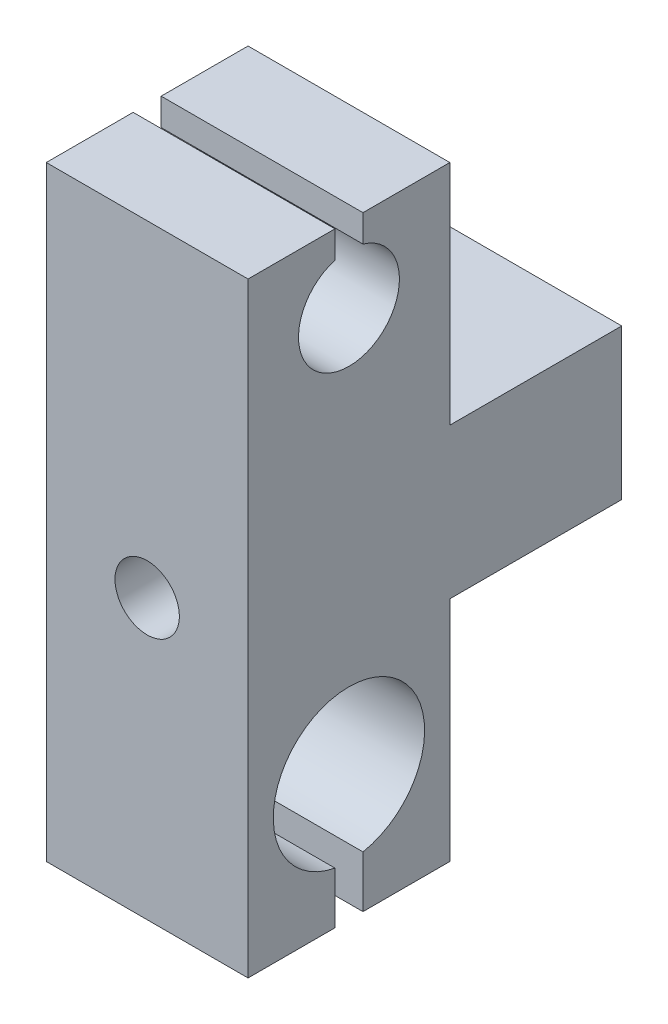
ISO-10303-21;
HEADER;
FILE_DESCRIPTION(('STEP AP214'),'2;1');
FILE_NAME('part.step','',(''),(''),'','','');
FILE_SCHEMA(('AUTOMOTIVE_DESIGN { 1 0 10303 214 1 1 1 1 }'));
ENDSEC;
DATA;
#1=APPLICATION_CONTEXT('core data for automotive mechanical design processes');
#2=APPLICATION_PROTOCOL_DEFINITION('international standard','automotive_design',2000,#1);
#3=PRODUCT_CONTEXT('',#1,'mechanical');
#4=PRODUCT('Part','Part','',(#3));
#5=PRODUCT_RELATED_PRODUCT_CATEGORY('part','',(#4));
#6=PRODUCT_DEFINITION_FORMATION('','',#4);
#7=PRODUCT_DEFINITION_CONTEXT('part definition',#1,'design');
#8=PRODUCT_DEFINITION('design','',#6,#7);
#9=PRODUCT_DEFINITION_SHAPE('','',#8);
#10=(LENGTH_UNIT() NAMED_UNIT(*) SI_UNIT(.MILLI.,.METRE.));
#11=(NAMED_UNIT(*) PLANE_ANGLE_UNIT() SI_UNIT($,.RADIAN.));
#12=(NAMED_UNIT(*) SI_UNIT($,.STERADIAN.) SOLID_ANGLE_UNIT());
#13=UNCERTAINTY_MEASURE_WITH_UNIT(LENGTH_MEASURE(1.E-05),#10,'distance_accuracy_value','');
#14=(GEOMETRIC_REPRESENTATION_CONTEXT(3) GLOBAL_UNCERTAINTY_ASSIGNED_CONTEXT((#13)) GLOBAL_UNIT_ASSIGNED_CONTEXT((#10,
#11,#12)) REPRESENTATION_CONTEXT('',''));
#15=CARTESIAN_POINT('',(0.,0.,0.));
#16=DIRECTION('',(0.,0.,1.));
#17=DIRECTION('',(1.,0.,0.));
#18=AXIS2_PLACEMENT_3D('',#15,#16,#17);
#19=CARTESIAN_POINT('',(25.4,38.1,1.76481784286325));
#20=DIRECTION('',(0.,-1.,0.));
#21=DIRECTION('',(0.,0.,-1.));
#22=AXIS2_PLACEMENT_3D('',#19,#20,#21);
#23=PLANE('',#22);
#24=DIRECTION('',(0.,0.,1.));
#25=VECTOR('',#24,1.);
#26=CARTESIAN_POINT('',(0.,38.1,1.76481784286325));
#27=LINE('',#26,#25);
#28=CARTESIAN_POINT('',(0.,38.1,1.76481784286325));
#29=VERTEX_POINT('',#28);
#30=CARTESIAN_POINT('',(0.,38.1,12.7));
#31=VERTEX_POINT('',#30);
#32=EDGE_CURVE('E180',#29,#31,#27,.T.);
#33=ORIENTED_EDGE('',*,*,#32,.T.);
#34=DIRECTION('',(-1.,0.,0.));
#35=VECTOR('',#34,1.);
#36=CARTESIAN_POINT('',(25.4,38.1,12.7));
#37=LINE('',#36,#35);
#38=CARTESIAN_POINT('',(25.4,38.1,12.7));
#39=VERTEX_POINT('',#38);
#40=EDGE_CURVE('E11',#39,#31,#37,.T.);
#41=ORIENTED_EDGE('',*,*,#40,.F.);
#42=DIRECTION('',(0.,0.,1.));
#43=VECTOR('',#42,1.);
#44=CARTESIAN_POINT('',(25.4,38.1,1.76481784286325));
#45=LINE('',#44,#43);
#46=CARTESIAN_POINT('',(25.4,38.1,1.76481784286325));
#47=VERTEX_POINT('',#46);
#48=EDGE_CURVE('E211',#47,#39,#45,.T.);
#49=ORIENTED_EDGE('',*,*,#48,.F.);
#50=DIRECTION('',(-1.,0.,0.));
#51=VECTOR('',#50,1.);
#52=CARTESIAN_POINT('',(25.4,38.1,1.76481784286325));
#53=LINE('',#52,#51);
#54=EDGE_CURVE('E176',#47,#29,#53,.T.);
#55=ORIENTED_EDGE('',*,*,#54,.T.);
#56=EDGE_LOOP('',(#33,#41,#49,#55));
#57=FACE_BOUND('',#56,.T.);
#58=ADVANCED_FACE('F36',(#57),#23,.F.);
#59=CARTESIAN_POINT('',(25.4,-38.1,12.7));
#60=DIRECTION('',(0.,0.,-1.));
#61=DIRECTION('',(-1.,0.,0.));
#62=AXIS2_PLACEMENT_3D('',#59,#60,#61);
#63=PLANE('',#62);
#64=CARTESIAN_POINT('',(12.7,-3.0027725286965,12.7));
#65=DIRECTION('',(0.,0.,-1.));
#66=DIRECTION('',(-1.,0.,0.));
#67=AXIS2_PLACEMENT_3D('',#64,#65,#66);
#68=CIRCLE('',#67,4.04999999968396);
#69=CARTESIAN_POINT('',(8.65000000031604,-3.0027725286965,12.7));
#70=VERTEX_POINT('',#69);
#71=EDGE_CURVE('E184',#70,#70,#68,.T.);
#72=ORIENTED_EDGE('',*,*,#71,.T.);
#73=EDGE_LOOP('',(#72));
#74=FACE_BOUND('',#73,.T.);
#75=DIRECTION('',(0.,-1.,0.));
#76=VECTOR('',#75,1.);
#77=CARTESIAN_POINT('',(0.,-38.1,12.7));
#78=LINE('',#77,#76);
#79=CARTESIAN_POINT('',(0.,-38.1,12.7));
#80=VERTEX_POINT('',#79);
#81=EDGE_CURVE('E183',#31,#80,#78,.T.);
#82=ORIENTED_EDGE('',*,*,#81,.T.);
#83=DIRECTION('',(-1.,0.,0.));
#84=VECTOR('',#83,1.);
#85=CARTESIAN_POINT('',(25.4,-38.1,12.7));
#86=LINE('',#85,#84);
#87=CARTESIAN_POINT('',(25.4,-38.1,12.7));
#88=VERTEX_POINT('',#87);
#89=EDGE_CURVE('E44',#88,#80,#86,.T.);
#90=ORIENTED_EDGE('',*,*,#89,.F.);
#91=DIRECTION('',(0.,-1.,0.));
#92=VECTOR('',#91,1.);
#93=CARTESIAN_POINT('',(25.4,-38.1,12.7));
#94=LINE('',#93,#92);
#95=EDGE_CURVE('E119',#39,#88,#94,.T.);
#96=ORIENTED_EDGE('',*,*,#95,.F.);
#97=ORIENTED_EDGE('',*,*,#40,.T.);
#98=EDGE_LOOP('',(#82,#90,#96,#97));
#99=FACE_BOUND('',#98,.T.);
#100=ADVANCED_FACE('F309',(#74,#99),#63,.F.);
#101=CARTESIAN_POINT('',(25.4,-38.1,1.76481784286325));
#102=DIRECTION('',(0.,1.,0.));
#103=DIRECTION('',(0.,0.,1.));
#104=AXIS2_PLACEMENT_3D('',#101,#102,#103);
#105=PLANE('',#104);
#106=DIRECTION('',(0.,0.,-1.));
#107=VECTOR('',#106,1.);
#108=CARTESIAN_POINT('',(0.,-38.1,1.76481784286325));
#109=LINE('',#108,#107);
#110=CARTESIAN_POINT('',(0.,-38.1,1.76481784286325));
#111=VERTEX_POINT('',#110);
#112=EDGE_CURVE('E186',#80,#111,#109,.T.);
#113=ORIENTED_EDGE('',*,*,#112,.T.);
#114=DIRECTION('',(-1.,0.,0.));
#115=VECTOR('',#114,1.);
#116=CARTESIAN_POINT('',(25.4,-38.1,1.76481784286325));
#117=LINE('',#116,#115);
#118=CARTESIAN_POINT('',(25.4,-38.1,1.76481784286325));
#119=VERTEX_POINT('',#118);
#120=EDGE_CURVE('E242',#119,#111,#117,.T.);
#121=ORIENTED_EDGE('',*,*,#120,.F.);
#122=DIRECTION('',(0.,0.,-1.));
#123=VECTOR('',#122,1.);
#124=CARTESIAN_POINT('',(25.4,-38.1,1.76481784286325));
#125=LINE('',#124,#123);
#126=EDGE_CURVE('E250',#88,#119,#125,.T.);
#127=ORIENTED_EDGE('',*,*,#126,.F.);
#128=ORIENTED_EDGE('',*,*,#89,.T.);
#129=EDGE_LOOP('',(#113,#121,#127,#128));
#130=FACE_BOUND('',#129,.T.);
#131=ADVANCED_FACE('F248',(#130),#105,.F.);
#132=CARTESIAN_POINT('',(25.4,-31.5850770820283,1.76481784286325));
#133=DIRECTION('',(0.,0.,1.));
#134=DIRECTION('',(1.,0.,0.));
#135=AXIS2_PLACEMENT_3D('',#132,#133,#134);
#136=PLANE('',#135);
#137=DIRECTION('',(0.,1.,0.));
#138=VECTOR('',#137,1.);
#139=CARTESIAN_POINT('',(0.,-31.5850770820283,1.76481784286325));
#140=LINE('',#139,#138);
#141=CARTESIAN_POINT('',(0.,-31.5850770820283,1.76481784286325));
#142=VERTEX_POINT('',#141);
#143=EDGE_CURVE('E188',#111,#142,#140,.T.);
#144=ORIENTED_EDGE('',*,*,#143,.T.);
#145=DIRECTION('',(-1.,0.,0.));
#146=VECTOR('',#145,1.);
#147=CARTESIAN_POINT('',(25.4,-31.5850770820283,1.76481784286325));
#148=LINE('',#147,#146);
#149=CARTESIAN_POINT('',(25.4,-31.5850770820283,1.76481784286325));
#150=VERTEX_POINT('',#149);
#151=EDGE_CURVE('E239',#150,#142,#148,.T.);
#152=ORIENTED_EDGE('',*,*,#151,.F.);
#153=DIRECTION('',(0.,1.,0.));
#154=VECTOR('',#153,1.);
#155=CARTESIAN_POINT('',(25.4,-31.5850770820283,1.76481784286325));
#156=LINE('',#155,#154);
#157=EDGE_CURVE('E268',#119,#150,#156,.T.);
#158=ORIENTED_EDGE('',*,*,#157,.F.);
#159=ORIENTED_EDGE('',*,*,#120,.T.);
#160=EDGE_LOOP('',(#144,#152,#158,#159));
#161=FACE_BOUND('',#160,.T.);
#162=ADVANCED_FACE('F259',(#161),#136,.F.);
#163=CARTESIAN_POINT('',(25.4,-22.225,0.));
#164=DIRECTION('',(-1.,0.,0.));
#165=DIRECTION('',(0.,0.,1.));
#166=AXIS2_PLACEMENT_3D('',#163,#164,#165);
#167=CYLINDRICAL_SURFACE('',#166,9.525);
#168=CARTESIAN_POINT('',(0.,-22.225,0.));
#169=DIRECTION('',(-1.,0.,0.));
#170=DIRECTION('',(0.,0.,-1.));
#171=AXIS2_PLACEMENT_3D('',#168,#169,#170);
#172=CIRCLE('',#171,9.525);
#173=CARTESIAN_POINT('',(0.,-31.5850770820283,-1.76481784286326));
#174=VERTEX_POINT('',#173);
#175=EDGE_CURVE('E190',#142,#174,#172,.T.);
#176=ORIENTED_EDGE('',*,*,#175,.T.);
#177=DIRECTION('',(-1.,0.,0.));
#178=VECTOR('',#177,1.);
#179=CARTESIAN_POINT('',(25.4,-31.5850770820283,-1.76481784286326));
#180=LINE('',#179,#178);
#181=CARTESIAN_POINT('',(25.4,-31.5850770820283,-1.76481784286326));
#182=VERTEX_POINT('',#181);
#183=EDGE_CURVE('E236',#182,#174,#180,.T.);
#184=ORIENTED_EDGE('',*,*,#183,.F.);
#185=CARTESIAN_POINT('',(25.4,-22.225,0.));
#186=DIRECTION('',(-1.,0.,0.));
#187=DIRECTION('',(0.,0.,-1.));
#188=AXIS2_PLACEMENT_3D('',#185,#186,#187);
#189=CIRCLE('',#188,9.525);
#190=EDGE_CURVE('E265',#150,#182,#189,.T.);
#191=ORIENTED_EDGE('',*,*,#190,.F.);
#192=ORIENTED_EDGE('',*,*,#151,.T.);
#193=EDGE_LOOP('',(#176,#184,#191,#192));
#194=FACE_BOUND('',#193,.T.);
#195=ADVANCED_FACE('F263',(#194),#167,.F.);
#196=CARTESIAN_POINT('',(25.4,-31.5850770820283,-1.76481784286326));
#197=DIRECTION('',(0.,0.,-1.));
#198=DIRECTION('',(0.,1.,0.));
#199=AXIS2_PLACEMENT_3D('',#196,#197,#198);
#200=PLANE('',#199);
#201=DIRECTION('',(0.,-1.,0.));
#202=VECTOR('',#201,1.);
#203=CARTESIAN_POINT('',(0.,-31.5850770820283,-1.76481784286326));
#204=LINE('',#203,#202);
#205=CARTESIAN_POINT('',(0.,-38.1,-1.76481784286326));
#206=VERTEX_POINT('',#205);
#207=EDGE_CURVE('E192',#174,#206,#204,.T.);
#208=ORIENTED_EDGE('',*,*,#207,.T.);
#209=DIRECTION('',(-1.,0.,0.));
#210=VECTOR('',#209,1.);
#211=CARTESIAN_POINT('',(25.4,-38.1,-1.76481784286326));
#212=LINE('',#211,#210);
#213=CARTESIAN_POINT('',(25.4,-38.1,-1.76481784286326));
#214=VERTEX_POINT('',#213);
#215=EDGE_CURVE('E233',#214,#206,#212,.T.);
#216=ORIENTED_EDGE('',*,*,#215,.F.);
#217=DIRECTION('',(0.,-1.,0.));
#218=VECTOR('',#217,1.);
#219=CARTESIAN_POINT('',(25.4,-31.5850770820283,-1.76481784286326));
#220=LINE('',#219,#218);
#221=EDGE_CURVE('E267',#182,#214,#220,.T.);
#222=ORIENTED_EDGE('',*,*,#221,.F.);
#223=ORIENTED_EDGE('',*,*,#183,.T.);
#224=EDGE_LOOP('',(#208,#216,#222,#223));
#225=FACE_BOUND('',#224,.T.);
#226=ADVANCED_FACE('F324',(#225),#200,.F.);
#227=CARTESIAN_POINT('',(25.4,-38.1,-12.7));
#228=DIRECTION('',(0.,1.,0.));
#229=DIRECTION('',(0.,0.,1.));
#230=AXIS2_PLACEMENT_3D('',#227,#228,#229);
#231=PLANE('',#230);
#232=DIRECTION('',(0.,0.,-1.));
#233=VECTOR('',#232,1.);
#234=CARTESIAN_POINT('',(0.,-38.1,-12.7));
#235=LINE('',#234,#233);
#236=CARTESIAN_POINT('',(0.,-38.1,-12.7));
#237=VERTEX_POINT('',#236);
#238=EDGE_CURVE('E194',#206,#237,#235,.T.);
#239=ORIENTED_EDGE('',*,*,#238,.T.);
#240=DIRECTION('',(-1.,0.,0.));
#241=VECTOR('',#240,1.);
#242=CARTESIAN_POINT('',(25.4,-38.1,-12.7));
#243=LINE('',#242,#241);
#244=CARTESIAN_POINT('',(25.4,-38.1,-12.7));
#245=VERTEX_POINT('',#244);
#246=EDGE_CURVE('E230',#245,#237,#243,.T.);
#247=ORIENTED_EDGE('',*,*,#246,.F.);
#248=DIRECTION('',(0.,0.,-1.));
#249=VECTOR('',#248,1.);
#250=CARTESIAN_POINT('',(25.4,-38.1,-12.7));
#251=LINE('',#250,#249);
#252=EDGE_CURVE('E270',#214,#245,#251,.T.);
#253=ORIENTED_EDGE('',*,*,#252,.F.);
#254=ORIENTED_EDGE('',*,*,#215,.T.);
#255=EDGE_LOOP('',(#239,#247,#253,#254));
#256=FACE_BOUND('',#255,.T.);
#257=ADVANCED_FACE('F327',(#256),#231,.F.);
#258=CARTESIAN_POINT('',(25.4,-38.1,-12.7));
#259=DIRECTION('',(0.,0.,1.));
#260=DIRECTION('',(1.,0.,0.));
#261=AXIS2_PLACEMENT_3D('',#258,#259,#260);
#262=PLANE('',#261);
#263=DIRECTION('',(0.,1.,0.));
#264=VECTOR('',#263,1.);
#265=CARTESIAN_POINT('',(0.,-38.1,-12.7));
#266=LINE('',#265,#264);
#267=CARTESIAN_POINT('',(0.,-9.46650416011348,-12.7));
#268=VERTEX_POINT('',#267);
#269=EDGE_CURVE('E196',#237,#268,#266,.T.);
#270=ORIENTED_EDGE('',*,*,#269,.T.);
#271=DIRECTION('',(-1.,0.,0.));
#272=VECTOR('',#271,1.);
#273=CARTESIAN_POINT('',(25.4,-9.46650416011348,-12.7));
#274=LINE('',#273,#272);
#275=CARTESIAN_POINT('',(25.4,-9.46650416011348,-12.7));
#276=VERTEX_POINT('',#275);
#277=EDGE_CURVE('E227',#276,#268,#274,.T.);
#278=ORIENTED_EDGE('',*,*,#277,.F.);
#279=DIRECTION('',(0.,1.,0.));
#280=VECTOR('',#279,1.);
#281=CARTESIAN_POINT('',(25.4,-38.1,-12.7));
#282=LINE('',#281,#280);
#283=EDGE_CURVE('E276',#245,#276,#282,.T.);
#284=ORIENTED_EDGE('',*,*,#283,.F.);
#285=ORIENTED_EDGE('',*,*,#246,.T.);
#286=EDGE_LOOP('',(#270,#278,#284,#285));
#287=FACE_BOUND('',#286,.T.);
#288=ADVANCED_FACE('F331',(#287),#262,.F.);
#289=CARTESIAN_POINT('',(25.4,-9.46650416011348,-34.3377));
#290=DIRECTION('',(0.,1.,0.));
#291=DIRECTION('',(0.,0.,1.));
#292=AXIS2_PLACEMENT_3D('',#289,#290,#291);
#293=PLANE('',#292);
#294=DIRECTION('',(0.,0.,-1.));
#295=VECTOR('',#294,1.);
#296=CARTESIAN_POINT('',(0.,-9.46650416011348,-34.3377));
#297=LINE('',#296,#295);
#298=CARTESIAN_POINT('',(0.,-9.46650416011348,-34.3377));
#299=VERTEX_POINT('',#298);
#300=EDGE_CURVE('E198',#268,#299,#297,.T.);
#301=ORIENTED_EDGE('',*,*,#300,.T.);
#302=DIRECTION('',(-1.,0.,0.));
#303=VECTOR('',#302,1.);
#304=CARTESIAN_POINT('',(25.4,-9.46650416011348,-34.3377));
#305=LINE('',#304,#303);
#306=CARTESIAN_POINT('',(25.4,-9.46650416011348,-34.3377));
#307=VERTEX_POINT('',#306);
#308=EDGE_CURVE('E224',#307,#299,#305,.T.);
#309=ORIENTED_EDGE('',*,*,#308,.F.);
#310=DIRECTION('',(0.,0.,-1.));
#311=VECTOR('',#310,1.);
#312=CARTESIAN_POINT('',(25.4,-9.46650416011348,-34.3377));
#313=LINE('',#312,#311);
#314=EDGE_CURVE('E278',#276,#307,#313,.T.);
#315=ORIENTED_EDGE('',*,*,#314,.F.);
#316=ORIENTED_EDGE('',*,*,#277,.T.);
#317=EDGE_LOOP('',(#301,#309,#315,#316));
#318=FACE_BOUND('',#317,.T.);
#319=ADVANCED_FACE('F335',(#318),#293,.F.);
#320=CARTESIAN_POINT('',(25.4,-9.46650416011348,-34.3377));
#321=DIRECTION('',(0.,0.,1.));
#322=DIRECTION('',(1.,0.,0.));
#323=AXIS2_PLACEMENT_3D('',#320,#321,#322);
#324=PLANE('',#323);
#325=CARTESIAN_POINT('',(12.7,-3.0027725286965,-34.3377));
#326=DIRECTION('',(0.,0.,-1.));
#327=DIRECTION('',(-1.,0.,0.));
#328=AXIS2_PLACEMENT_3D('',#325,#326,#327);
#329=CIRCLE('',#328,4.04999999968396);
#330=CARTESIAN_POINT('',(8.65000000031604,-3.0027725286965,-34.3377));
#331=VERTEX_POINT('',#330);
#332=EDGE_CURVE('E410',#331,#331,#329,.T.);
#333=ORIENTED_EDGE('',*,*,#332,.F.);
#334=EDGE_LOOP('',(#333));
#335=FACE_BOUND('',#334,.T.);
#336=DIRECTION('',(0.,1.,0.));
#337=VECTOR('',#336,1.);
#338=CARTESIAN_POINT('',(0.,-9.46650416011348,-34.3377));
#339=LINE('',#338,#337);
#340=CARTESIAN_POINT('',(0.,9.46650416011348,-34.3377));
#341=VERTEX_POINT('',#340);
#342=EDGE_CURVE('E200',#299,#341,#339,.T.);
#343=ORIENTED_EDGE('',*,*,#342,.T.);
#344=DIRECTION('',(-1.,0.,0.));
#345=VECTOR('',#344,1.);
#346=CARTESIAN_POINT('',(25.4,9.46650416011348,-34.3377));
#347=LINE('',#346,#345);
#348=CARTESIAN_POINT('',(25.4,9.46650416011348,-34.3377));
#349=VERTEX_POINT('',#348);
#350=EDGE_CURVE('E221',#349,#341,#347,.T.);
#351=ORIENTED_EDGE('',*,*,#350,.F.);
#352=DIRECTION('',(0.,1.,0.));
#353=VECTOR('',#352,1.);
#354=CARTESIAN_POINT('',(25.4,-9.46650416011348,-34.3377));
#355=LINE('',#354,#353);
#356=EDGE_CURVE('E280',#307,#349,#355,.T.);
#357=ORIENTED_EDGE('',*,*,#356,.F.);
#358=ORIENTED_EDGE('',*,*,#308,.T.);
#359=EDGE_LOOP('',(#343,#351,#357,#358));
#360=FACE_BOUND('',#359,.T.);
#361=ADVANCED_FACE('F339',(#335,#360),#324,.F.);
#362=CARTESIAN_POINT('',(25.4,9.46650416011348,-34.3377));
#363=DIRECTION('',(0.,-1.,0.));
#364=DIRECTION('',(0.,0.,-1.));
#365=AXIS2_PLACEMENT_3D('',#362,#363,#364);
#366=PLANE('',#365);
#367=DIRECTION('',(0.,0.,1.));
#368=VECTOR('',#367,1.);
#369=CARTESIAN_POINT('',(0.,9.46650416011348,-34.3377));
#370=LINE('',#369,#368);
#371=CARTESIAN_POINT('',(0.,9.46650416011348,-12.7));
#372=VERTEX_POINT('',#371);
#373=EDGE_CURVE('E202',#341,#372,#370,.T.);
#374=ORIENTED_EDGE('',*,*,#373,.T.);
#375=DIRECTION('',(-1.,0.,0.));
#376=VECTOR('',#375,1.);
#377=CARTESIAN_POINT('',(25.4,9.46650416011348,-12.7));
#378=LINE('',#377,#376);
#379=CARTESIAN_POINT('',(25.4,9.46650416011348,-12.7));
#380=VERTEX_POINT('',#379);
#381=EDGE_CURVE('E218',#380,#372,#378,.T.);
#382=ORIENTED_EDGE('',*,*,#381,.F.);
#383=DIRECTION('',(0.,0.,1.));
#384=VECTOR('',#383,1.);
#385=CARTESIAN_POINT('',(25.4,9.46650416011348,-34.3377));
#386=LINE('',#385,#384);
#387=EDGE_CURVE('E282',#349,#380,#386,.T.);
#388=ORIENTED_EDGE('',*,*,#387,.F.);
#389=ORIENTED_EDGE('',*,*,#350,.T.);
#390=EDGE_LOOP('',(#374,#382,#388,#389));
#391=FACE_BOUND('',#390,.T.);
#392=ADVANCED_FACE('F343',(#391),#366,.F.);
#393=CARTESIAN_POINT('',(25.4,9.46650416011348,-12.7));
#394=DIRECTION('',(0.,0.,1.));
#395=DIRECTION('',(1.,0.,0.));
#396=AXIS2_PLACEMENT_3D('',#393,#394,#395);
#397=PLANE('',#396);
#398=DIRECTION('',(0.,1.,0.));
#399=VECTOR('',#398,1.);
#400=CARTESIAN_POINT('',(0.,9.46650416011348,-12.7));
#401=LINE('',#400,#399);
#402=CARTESIAN_POINT('',(0.,38.1,-12.7));
#403=VERTEX_POINT('',#402);
#404=EDGE_CURVE('E204',#372,#403,#401,.T.);
#405=ORIENTED_EDGE('',*,*,#404,.T.);
#406=DIRECTION('',(-1.,0.,0.));
#407=VECTOR('',#406,1.);
#408=CARTESIAN_POINT('',(25.4,38.1,-12.7));
#409=LINE('',#408,#407);
#410=CARTESIAN_POINT('',(25.4,38.1,-12.7));
#411=VERTEX_POINT('',#410);
#412=EDGE_CURVE('E215',#411,#403,#409,.T.);
#413=ORIENTED_EDGE('',*,*,#412,.F.);
#414=DIRECTION('',(0.,1.,0.));
#415=VECTOR('',#414,1.);
#416=CARTESIAN_POINT('',(25.4,9.46650416011348,-12.7));
#417=LINE('',#416,#415);
#418=EDGE_CURVE('E284',#380,#411,#417,.T.);
#419=ORIENTED_EDGE('',*,*,#418,.F.);
#420=ORIENTED_EDGE('',*,*,#381,.T.);
#421=EDGE_LOOP('',(#405,#413,#419,#420));
#422=FACE_BOUND('',#421,.T.);
#423=ADVANCED_FACE('F290',(#422),#397,.F.);
#424=CARTESIAN_POINT('',(25.4,38.1,-12.7));
#425=DIRECTION('',(0.,-1.,0.));
#426=DIRECTION('',(0.,0.,-1.));
#427=AXIS2_PLACEMENT_3D('',#424,#425,#426);
#428=PLANE('',#427);
#429=DIRECTION('',(0.,0.,1.));
#430=VECTOR('',#429,1.);
#431=CARTESIAN_POINT('',(0.,38.1,-12.7));
#432=LINE('',#431,#430);
#433=CARTESIAN_POINT('',(0.,38.1,-1.76481784286325));
#434=VERTEX_POINT('',#433);
#435=EDGE_CURVE('E206',#403,#434,#432,.T.);
#436=ORIENTED_EDGE('',*,*,#435,.T.);
#437=DIRECTION('',(-1.,0.,0.));
#438=VECTOR('',#437,1.);
#439=CARTESIAN_POINT('',(25.4,38.1,-1.76481784286325));
#440=LINE('',#439,#438);
#441=CARTESIAN_POINT('',(25.4,38.1,-1.76481784286325));
#442=VERTEX_POINT('',#441);
#443=EDGE_CURVE('E171',#442,#434,#440,.T.);
#444=ORIENTED_EDGE('',*,*,#443,.F.);
#445=DIRECTION('',(0.,0.,1.));
#446=VECTOR('',#445,1.);
#447=CARTESIAN_POINT('',(25.4,38.1,-12.7));
#448=LINE('',#447,#446);
#449=EDGE_CURVE('E162',#411,#442,#448,.T.);
#450=ORIENTED_EDGE('',*,*,#449,.F.);
#451=ORIENTED_EDGE('',*,*,#412,.T.);
#452=EDGE_LOOP('',(#436,#444,#450,#451));
#453=FACE_BOUND('',#452,.T.);
#454=ADVANCED_FACE('F294',(#453),#428,.F.);
#455=CARTESIAN_POINT('',(25.4,38.1,-1.76481784286325));
#456=DIRECTION('',(0.,0.,-1.));
#457=DIRECTION('',(-1.,0.,0.));
#458=AXIS2_PLACEMENT_3D('',#455,#456,#457);
#459=PLANE('',#458);
#460=DIRECTION('',(0.,-1.,0.));
#461=VECTOR('',#460,1.);
#462=CARTESIAN_POINT('',(0.,38.1,-1.76481784286325));
#463=LINE('',#462,#461);
#464=CARTESIAN_POINT('',(0.,34.6748293403596,-1.76481784286325));
#465=VERTEX_POINT('',#464);
#466=EDGE_CURVE('E170',#434,#465,#463,.T.);
#467=ORIENTED_EDGE('',*,*,#466,.T.);
#468=DIRECTION('',(-1.,0.,0.));
#469=VECTOR('',#468,1.);
#470=CARTESIAN_POINT('',(25.4,34.6748293403596,-1.76481784286325));
#471=LINE('',#470,#469);
#472=CARTESIAN_POINT('',(25.4,34.6748293403596,-1.76481784286325));
#473=VERTEX_POINT('',#472);
#474=EDGE_CURVE('E167',#473,#465,#471,.T.);
#475=ORIENTED_EDGE('',*,*,#474,.F.);
#476=DIRECTION('',(0.,-1.,0.));
#477=VECTOR('',#476,1.);
#478=CARTESIAN_POINT('',(25.4,38.1,-1.76481784286325));
#479=LINE('',#478,#477);
#480=EDGE_CURVE('E156',#442,#473,#479,.T.);
#481=ORIENTED_EDGE('',*,*,#480,.F.);
#482=ORIENTED_EDGE('',*,*,#443,.T.);
#483=EDGE_LOOP('',(#467,#475,#481,#482));
#484=FACE_BOUND('',#483,.T.);
#485=ADVANCED_FACE('F168',(#484),#459,.F.);
#486=CARTESIAN_POINT('',(25.4,28.575,0.));
#487=DIRECTION('',(-1.,0.,0.));
#488=DIRECTION('',(0.,0.,1.));
#489=AXIS2_PLACEMENT_3D('',#486,#487,#488);
#490=CYLINDRICAL_SURFACE('',#489,6.35);
#491=CARTESIAN_POINT('',(0.,28.575,0.));
#492=DIRECTION('',(-1.,0.,0.));
#493=DIRECTION('',(0.,0.,-1.));
#494=AXIS2_PLACEMENT_3D('',#491,#492,#493);
#495=CIRCLE('',#494,6.35);
#496=CARTESIAN_POINT('',(0.,34.6748293403596,1.76481784286325));
#497=VERTEX_POINT('',#496);
#498=EDGE_CURVE('E105',#465,#497,#495,.T.);
#499=ORIENTED_EDGE('',*,*,#498,.T.);
#500=DIRECTION('',(-1.,0.,0.));
#501=VECTOR('',#500,1.);
#502=CARTESIAN_POINT('',(25.4,34.6748293403596,1.76481784286325));
#503=LINE('',#502,#501);
#504=CARTESIAN_POINT('',(25.4,34.6748293403596,1.76481784286325));
#505=VERTEX_POINT('',#504);
#506=EDGE_CURVE('E172',#505,#497,#503,.T.);
#507=ORIENTED_EDGE('',*,*,#506,.F.);
#508=CARTESIAN_POINT('',(25.4,28.575,0.));
#509=DIRECTION('',(-1.,0.,0.));
#510=DIRECTION('',(0.,0.,-1.));
#511=AXIS2_PLACEMENT_3D('',#508,#509,#510);
#512=CIRCLE('',#511,6.35);
#513=EDGE_CURVE('E160',#473,#505,#512,.T.);
#514=ORIENTED_EDGE('',*,*,#513,.F.);
#515=ORIENTED_EDGE('',*,*,#474,.T.);
#516=EDGE_LOOP('',(#499,#507,#514,#515));
#517=FACE_BOUND('',#516,.T.);
#518=ADVANCED_FACE('F174',(#517),#490,.F.);
#519=CARTESIAN_POINT('',(25.4,38.1,1.76481784286325));
#520=DIRECTION('',(0.,0.,1.));
#521=DIRECTION('',(1.,0.,0.));
#522=AXIS2_PLACEMENT_3D('',#519,#520,#521);
#523=PLANE('',#522);
#524=DIRECTION('',(0.,1.,0.));
#525=VECTOR('',#524,1.);
#526=CARTESIAN_POINT('',(0.,38.1,1.76481784286325));
#527=LINE('',#526,#525);
#528=EDGE_CURVE('E111',#497,#29,#527,.T.);
#529=ORIENTED_EDGE('',*,*,#528,.T.);
#530=ORIENTED_EDGE('',*,*,#54,.F.);
#531=DIRECTION('',(0.,1.,0.));
#532=VECTOR('',#531,1.);
#533=CARTESIAN_POINT('',(25.4,38.1,1.76481784286325));
#534=LINE('',#533,#532);
#535=EDGE_CURVE('E52',#505,#47,#534,.T.);
#536=ORIENTED_EDGE('',*,*,#535,.F.);
#537=ORIENTED_EDGE('',*,*,#506,.T.);
#538=EDGE_LOOP('',(#529,#530,#536,#537));
#539=FACE_BOUND('',#538,.T.);
#540=ADVANCED_FACE('F298',(#539),#523,.F.);
#541=CARTESIAN_POINT('',(25.4,-22.225,0.));
#542=DIRECTION('',(1.,0.,0.));
#543=DIRECTION('',(0.,0.,-1.));
#544=AXIS2_PLACEMENT_3D('',#541,#542,#543);
#545=PLANE('',#544);
#546=ORIENTED_EDGE('',*,*,#48,.T.);
#547=ORIENTED_EDGE('',*,*,#95,.T.);
#548=ORIENTED_EDGE('',*,*,#126,.T.);
#549=ORIENTED_EDGE('',*,*,#157,.T.);
#550=ORIENTED_EDGE('',*,*,#190,.T.);
#551=ORIENTED_EDGE('',*,*,#221,.T.);
#552=ORIENTED_EDGE('',*,*,#252,.T.);
#553=ORIENTED_EDGE('',*,*,#283,.T.);
#554=ORIENTED_EDGE('',*,*,#314,.T.);
#555=ORIENTED_EDGE('',*,*,#356,.T.);
#556=ORIENTED_EDGE('',*,*,#387,.T.);
#557=ORIENTED_EDGE('',*,*,#418,.T.);
#558=ORIENTED_EDGE('',*,*,#449,.T.);
#559=ORIENTED_EDGE('',*,*,#480,.T.);
#560=ORIENTED_EDGE('',*,*,#513,.T.);
#561=ORIENTED_EDGE('',*,*,#535,.T.);
#562=EDGE_LOOP('',(#546,#547,#548,#549,#550,#551,#552,#553,#554,#555,#556,#557,#558,#559,#560,#561));
#563=FACE_BOUND('',#562,.T.);
#564=ADVANCED_FACE('F158',(#563),#545,.T.);
#565=CARTESIAN_POINT('',(0.,-22.225,0.));
#566=DIRECTION('',(1.,0.,0.));
#567=DIRECTION('',(0.,0.,-1.));
#568=AXIS2_PLACEMENT_3D('',#565,#566,#567);
#569=PLANE('',#568);
#570=ORIENTED_EDGE('',*,*,#32,.F.);
#571=ORIENTED_EDGE('',*,*,#528,.F.);
#572=ORIENTED_EDGE('',*,*,#498,.F.);
#573=ORIENTED_EDGE('',*,*,#466,.F.);
#574=ORIENTED_EDGE('',*,*,#435,.F.);
#575=ORIENTED_EDGE('',*,*,#404,.F.);
#576=ORIENTED_EDGE('',*,*,#373,.F.);
#577=ORIENTED_EDGE('',*,*,#342,.F.);
#578=ORIENTED_EDGE('',*,*,#300,.F.);
#579=ORIENTED_EDGE('',*,*,#269,.F.);
#580=ORIENTED_EDGE('',*,*,#238,.F.);
#581=ORIENTED_EDGE('',*,*,#207,.F.);
#582=ORIENTED_EDGE('',*,*,#175,.F.);
#583=ORIENTED_EDGE('',*,*,#143,.F.);
#584=ORIENTED_EDGE('',*,*,#112,.F.);
#585=ORIENTED_EDGE('',*,*,#81,.F.);
#586=EDGE_LOOP('',(#570,#571,#572,#573,#574,#575,#576,#577,#578,#579,#580,#581,#582,#583,#584,#585));
#587=FACE_BOUND('',#586,.T.);
#588=ADVANCED_FACE('F254',(#587),#569,.F.);
#589=CARTESIAN_POINT('',(12.7,-3.0027725286965,12.7));
#590=DIRECTION('',(0.,0.,-1.));
#591=DIRECTION('',(-1.,0.,0.));
#592=AXIS2_PLACEMENT_3D('',#589,#590,#591);
#593=CYLINDRICAL_SURFACE('',#592,4.04999999968396);
#594=ORIENTED_EDGE('',*,*,#71,.F.);
#595=EDGE_LOOP('',(#594));
#596=FACE_BOUND('',#595,.T.);
#597=ORIENTED_EDGE('',*,*,#332,.T.);
#598=EDGE_LOOP('',(#597));
#599=FACE_BOUND('',#598,.T.);
#600=ADVANCED_FACE('F379',(#596,#599),#593,.F.);
#601=CLOSED_SHELL('',(#58,#100,#131,#162,#195,#226,#257,#288,#319,#361,#392,#423,#454,#485,#518,
#540,#564,#588,#600));
#602=MANIFOLD_SOLID_BREP('B2',#601);
#603=ADVANCED_BREP_SHAPE_REPRESENTATION('',(#18,#602),#14);
#604=SHAPE_DEFINITION_REPRESENTATION(#9,#603);
ENDSEC;
END-ISO-10303-21;
